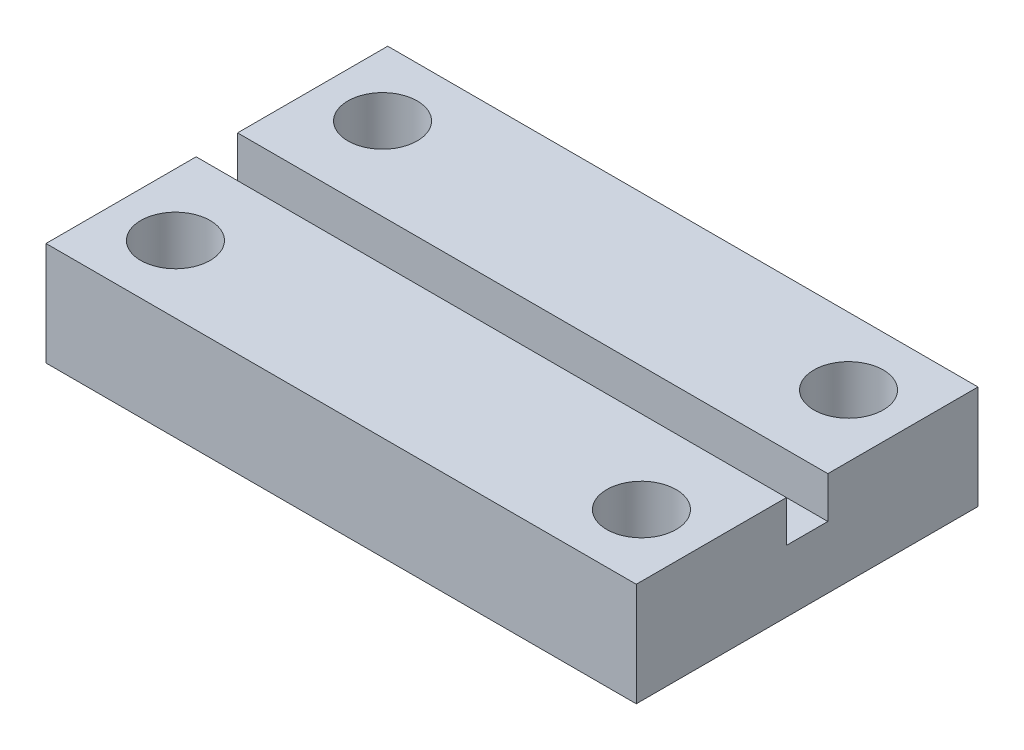
ISO-10303-21;
HEADER;
FILE_DESCRIPTION(('STEP AP214'),'2;1');
FILE_NAME('part.step','',(''),(''),'','','');
FILE_SCHEMA(('AUTOMOTIVE_DESIGN { 1 0 10303 214 1 1 1 1 }'));
ENDSEC;
DATA;
#1=APPLICATION_CONTEXT('core data for automotive mechanical design processes');
#2=APPLICATION_PROTOCOL_DEFINITION('international standard','automotive_design',2000,#1);
#3=PRODUCT_CONTEXT('',#1,'mechanical');
#4=PRODUCT('Part','Part','',(#3));
#5=PRODUCT_RELATED_PRODUCT_CATEGORY('part','',(#4));
#6=PRODUCT_DEFINITION_FORMATION('','',#4);
#7=PRODUCT_DEFINITION_CONTEXT('part definition',#1,'design');
#8=PRODUCT_DEFINITION('design','',#6,#7);
#9=PRODUCT_DEFINITION_SHAPE('','',#8);
#10=(LENGTH_UNIT() NAMED_UNIT(*) SI_UNIT(.MILLI.,.METRE.));
#11=(NAMED_UNIT(*) PLANE_ANGLE_UNIT() SI_UNIT($,.RADIAN.));
#12=(NAMED_UNIT(*) SI_UNIT($,.STERADIAN.) SOLID_ANGLE_UNIT());
#13=UNCERTAINTY_MEASURE_WITH_UNIT(LENGTH_MEASURE(1.E-05),#10,'distance_accuracy_value','');
#14=(GEOMETRIC_REPRESENTATION_CONTEXT(3) GLOBAL_UNCERTAINTY_ASSIGNED_CONTEXT((#13)) GLOBAL_UNIT_ASSIGNED_CONTEXT((#10,
#11,#12)) REPRESENTATION_CONTEXT('',''));
#15=CARTESIAN_POINT('',(0.,0.,0.));
#16=DIRECTION('',(0.,0.,1.));
#17=DIRECTION('',(1.,0.,0.));
#18=AXIS2_PLACEMENT_3D('',#15,#16,#17);
#19=CARTESIAN_POINT('',(0.,10.,0.));
#20=DIRECTION('',(0.,-1.,0.));
#21=DIRECTION('',(0.,0.,-1.));
#22=AXIS2_PLACEMENT_3D('',#19,#20,#21);
#23=PLANE('',#22);
#24=CARTESIAN_POINT('',(51.,10.,-26.5));
#25=DIRECTION('',(0.,-1.,0.));
#26=DIRECTION('',(0.,0.,-1.));
#27=AXIS2_PLACEMENT_3D('',#24,#25,#26);
#28=CIRCLE('',#27,3.35);
#29=CARTESIAN_POINT('',(51.,10.,-29.85));
#30=VERTEX_POINT('',#29);
#31=EDGE_CURVE('E145',#30,#30,#28,.T.);
#32=ORIENTED_EDGE('',*,*,#31,.T.);
#33=EDGE_LOOP('',(#32));
#34=FACE_BOUND('',#33,.T.);
#35=CARTESIAN_POINT('',(6.,10.,-26.5));
#36=DIRECTION('',(0.,-1.,0.));
#37=DIRECTION('',(0.,0.,-1.));
#38=AXIS2_PLACEMENT_3D('',#35,#36,#37);
#39=CIRCLE('',#38,3.35);
#40=CARTESIAN_POINT('',(6.,10.,-29.85));
#41=VERTEX_POINT('',#40);
#42=EDGE_CURVE('E139',#41,#41,#39,.T.);
#43=ORIENTED_EDGE('',*,*,#42,.T.);
#44=EDGE_LOOP('',(#43));
#45=FACE_BOUND('',#44,.T.);
#46=DIRECTION('',(0.,0.,1.));
#47=VECTOR('',#46,1.);
#48=CARTESIAN_POINT('',(0.,10.,0.));
#49=LINE('',#48,#47);
#50=CARTESIAN_POINT('',(0.,10.,-33.));
#51=VERTEX_POINT('',#50);
#52=CARTESIAN_POINT('',(0.,10.,-18.5));
#53=VERTEX_POINT('',#52);
#54=EDGE_CURVE('E157',#51,#53,#49,.T.);
#55=ORIENTED_EDGE('',*,*,#54,.T.);
#56=DIRECTION('',(-1.,0.,0.));
#57=VECTOR('',#56,1.);
#58=CARTESIAN_POINT('',(0.,10.,-18.5));
#59=LINE('',#58,#57);
#60=CARTESIAN_POINT('',(57.,10.,-18.5));
#61=VERTEX_POINT('',#60);
#62=EDGE_CURVE('E122',#61,#53,#59,.T.);
#63=ORIENTED_EDGE('',*,*,#62,.F.);
#64=DIRECTION('',(0.,0.,-1.));
#65=VECTOR('',#64,1.);
#66=CARTESIAN_POINT('',(57.,10.,0.));
#67=LINE('',#66,#65);
#68=CARTESIAN_POINT('',(57.,10.,-33.));
#69=VERTEX_POINT('',#68);
#70=EDGE_CURVE('E161',#61,#69,#67,.T.);
#71=ORIENTED_EDGE('',*,*,#70,.T.);
#72=DIRECTION('',(-1.,0.,0.));
#73=VECTOR('',#72,1.);
#74=CARTESIAN_POINT('',(0.,10.,-33.));
#75=LINE('',#74,#73);
#76=EDGE_CURVE('E56',#69,#51,#75,.T.);
#77=ORIENTED_EDGE('',*,*,#76,.T.);
#78=EDGE_LOOP('',(#55,#63,#71,#77));
#79=FACE_BOUND('',#78,.T.);
#80=ADVANCED_FACE('F32',(#34,#45,#79),#23,.F.);
#81=CARTESIAN_POINT('',(0.,10.,0.));
#82=DIRECTION('',(1.,0.,0.));
#83=DIRECTION('',(0.,0.,-1.));
#84=AXIS2_PLACEMENT_3D('',#81,#82,#83);
#85=PLANE('',#84);
#86=DIRECTION('',(0.,0.,1.));
#87=VECTOR('',#86,1.);
#88=CARTESIAN_POINT('',(0.,6.,-18.5));
#89=LINE('',#88,#87);
#90=CARTESIAN_POINT('',(0.,6.,-18.5));
#91=VERTEX_POINT('',#90);
#92=CARTESIAN_POINT('',(0.,6.,-14.5));
#93=VERTEX_POINT('',#92);
#94=EDGE_CURVE('E113',#91,#93,#89,.T.);
#95=ORIENTED_EDGE('',*,*,#94,.F.);
#96=DIRECTION('',(0.,1.,0.));
#97=VECTOR('',#96,1.);
#98=CARTESIAN_POINT('',(0.,6.,-18.5));
#99=LINE('',#98,#97);
#100=EDGE_CURVE('E138',#91,#53,#99,.T.);
#101=ORIENTED_EDGE('',*,*,#100,.T.);
#102=ORIENTED_EDGE('',*,*,#54,.F.);
#103=DIRECTION('',(0.,-1.,0.));
#104=VECTOR('',#103,1.);
#105=CARTESIAN_POINT('',(0.,10.,-33.));
#106=LINE('',#105,#104);
#107=CARTESIAN_POINT('',(0.,0.,-33.));
#108=VERTEX_POINT('',#107);
#109=EDGE_CURVE('E166',#51,#108,#106,.T.);
#110=ORIENTED_EDGE('',*,*,#109,.T.);
#111=DIRECTION('',(0.,0.,1.));
#112=VECTOR('',#111,1.);
#113=CARTESIAN_POINT('',(0.,0.,0.));
#114=LINE('',#113,#112);
#115=CARTESIAN_POINT('',(0.,0.,0.));
#116=VERTEX_POINT('',#115);
#117=EDGE_CURVE('E154',#108,#116,#114,.T.);
#118=ORIENTED_EDGE('',*,*,#117,.T.);
#119=DIRECTION('',(0.,-1.,0.));
#120=VECTOR('',#119,1.);
#121=CARTESIAN_POINT('',(0.,10.,0.));
#122=LINE('',#121,#120);
#123=CARTESIAN_POINT('',(0.,10.,0.));
#124=VERTEX_POINT('',#123);
#125=EDGE_CURVE('E11',#124,#116,#122,.T.);
#126=ORIENTED_EDGE('',*,*,#125,.F.);
#127=CARTESIAN_POINT('',(0.,10.,-14.5));
#128=VERTEX_POINT('',#127);
#129=EDGE_CURVE('E84',#128,#124,#49,.T.);
#130=ORIENTED_EDGE('',*,*,#129,.F.);
#131=DIRECTION('',(0.,1.,0.));
#132=VECTOR('',#131,1.);
#133=CARTESIAN_POINT('',(0.,6.,-14.5));
#134=LINE('',#133,#132);
#135=EDGE_CURVE('E47',#93,#128,#134,.T.);
#136=ORIENTED_EDGE('',*,*,#135,.F.);
#137=EDGE_LOOP('',(#95,#101,#102,#110,#118,#126,#130,#136));
#138=FACE_BOUND('',#137,.T.);
#139=ADVANCED_FACE('F34',(#138),#85,.F.);
#140=CARTESIAN_POINT('',(0.,10.,0.));
#141=DIRECTION('',(0.,0.,-1.));
#142=DIRECTION('',(-1.,0.,0.));
#143=AXIS2_PLACEMENT_3D('',#140,#141,#142);
#144=PLANE('',#143);
#145=DIRECTION('',(1.,0.,0.));
#146=VECTOR('',#145,1.);
#147=CARTESIAN_POINT('',(0.,0.,0.));
#148=LINE('',#147,#146);
#149=CARTESIAN_POINT('',(57.,0.,0.));
#150=VERTEX_POINT('',#149);
#151=EDGE_CURVE('E169',#116,#150,#148,.T.);
#152=ORIENTED_EDGE('',*,*,#151,.T.);
#153=DIRECTION('',(0.,-1.,0.));
#154=VECTOR('',#153,1.);
#155=CARTESIAN_POINT('',(57.,10.,0.));
#156=LINE('',#155,#154);
#157=CARTESIAN_POINT('',(57.,10.,0.));
#158=VERTEX_POINT('',#157);
#159=EDGE_CURVE('E40',#158,#150,#156,.T.);
#160=ORIENTED_EDGE('',*,*,#159,.F.);
#161=DIRECTION('',(1.,0.,0.));
#162=VECTOR('',#161,1.);
#163=CARTESIAN_POINT('',(0.,10.,0.));
#164=LINE('',#163,#162);
#165=EDGE_CURVE('E159',#124,#158,#164,.T.);
#166=ORIENTED_EDGE('',*,*,#165,.F.);
#167=ORIENTED_EDGE('',*,*,#125,.T.);
#168=EDGE_LOOP('',(#152,#160,#166,#167));
#169=FACE_BOUND('',#168,.T.);
#170=ADVANCED_FACE('F217',(#169),#144,.F.);
#171=CARTESIAN_POINT('',(57.,10.,0.));
#172=DIRECTION('',(-1.,0.,0.));
#173=DIRECTION('',(0.,0.,1.));
#174=AXIS2_PLACEMENT_3D('',#171,#172,#173);
#175=PLANE('',#174);
#176=ORIENTED_EDGE('',*,*,#70,.F.);
#177=DIRECTION('',(0.,1.,0.));
#178=VECTOR('',#177,1.);
#179=CARTESIAN_POINT('',(57.,6.,-18.5));
#180=LINE('',#179,#178);
#181=CARTESIAN_POINT('',(57.,6.,-18.5));
#182=VERTEX_POINT('',#181);
#183=EDGE_CURVE('E126',#182,#61,#180,.T.);
#184=ORIENTED_EDGE('',*,*,#183,.F.);
#185=DIRECTION('',(0.,0.,-1.));
#186=VECTOR('',#185,1.);
#187=CARTESIAN_POINT('',(57.,6.,-18.5));
#188=LINE('',#187,#186);
#189=CARTESIAN_POINT('',(57.,6.,-14.5));
#190=VERTEX_POINT('',#189);
#191=EDGE_CURVE('E112',#190,#182,#188,.T.);
#192=ORIENTED_EDGE('',*,*,#191,.F.);
#193=DIRECTION('',(0.,1.,0.));
#194=VECTOR('',#193,1.);
#195=CARTESIAN_POINT('',(57.,6.,-14.5));
#196=LINE('',#195,#194);
#197=CARTESIAN_POINT('',(57.,10.,-14.5));
#198=VERTEX_POINT('',#197);
#199=EDGE_CURVE('E109',#190,#198,#196,.T.);
#200=ORIENTED_EDGE('',*,*,#199,.T.);
#201=EDGE_CURVE('E162',#158,#198,#67,.T.);
#202=ORIENTED_EDGE('',*,*,#201,.F.);
#203=ORIENTED_EDGE('',*,*,#159,.T.);
#204=DIRECTION('',(0.,0.,-1.));
#205=VECTOR('',#204,1.);
#206=CARTESIAN_POINT('',(57.,0.,0.));
#207=LINE('',#206,#205);
#208=CARTESIAN_POINT('',(57.,0.,-33.));
#209=VERTEX_POINT('',#208);
#210=EDGE_CURVE('E171',#150,#209,#207,.T.);
#211=ORIENTED_EDGE('',*,*,#210,.T.);
#212=DIRECTION('',(0.,-1.,0.));
#213=VECTOR('',#212,1.);
#214=CARTESIAN_POINT('',(57.,10.,-33.));
#215=LINE('',#214,#213);
#216=EDGE_CURVE('E175',#69,#209,#215,.T.);
#217=ORIENTED_EDGE('',*,*,#216,.F.);
#218=EDGE_LOOP('',(#176,#184,#192,#200,#202,#203,#211,#217));
#219=FACE_BOUND('',#218,.T.);
#220=ADVANCED_FACE('F182',(#219),#175,.F.);
#221=CARTESIAN_POINT('',(0.,10.,-33.));
#222=DIRECTION('',(0.,0.,1.));
#223=DIRECTION('',(1.,0.,0.));
#224=AXIS2_PLACEMENT_3D('',#221,#222,#223);
#225=PLANE('',#224);
#226=DIRECTION('',(-1.,0.,0.));
#227=VECTOR('',#226,1.);
#228=CARTESIAN_POINT('',(0.,0.,-33.));
#229=LINE('',#228,#227);
#230=EDGE_CURVE('E77',#209,#108,#229,.T.);
#231=ORIENTED_EDGE('',*,*,#230,.T.);
#232=ORIENTED_EDGE('',*,*,#109,.F.);
#233=ORIENTED_EDGE('',*,*,#76,.F.);
#234=ORIENTED_EDGE('',*,*,#216,.T.);
#235=EDGE_LOOP('',(#231,#232,#233,#234));
#236=FACE_BOUND('',#235,.T.);
#237=ADVANCED_FACE('F189',(#236),#225,.F.);
#238=CARTESIAN_POINT('',(51.,10.,-6.5));
#239=DIRECTION('',(0.,-1.,0.));
#240=DIRECTION('',(0.,0.,-1.));
#241=AXIS2_PLACEMENT_3D('',#238,#239,#240);
#242=CIRCLE('',#241,3.35);
#243=CARTESIAN_POINT('',(51.,10.,-9.85));
#244=VERTEX_POINT('',#243);
#245=EDGE_CURVE('E131',#244,#244,#242,.T.);
#246=ORIENTED_EDGE('',*,*,#245,.T.);
#247=EDGE_LOOP('',(#246));
#248=FACE_BOUND('',#247,.T.);
#249=CARTESIAN_POINT('',(6.,10.,-6.5));
#250=DIRECTION('',(0.,-1.,0.));
#251=DIRECTION('',(0.,0.,-1.));
#252=AXIS2_PLACEMENT_3D('',#249,#250,#251);
#253=CIRCLE('',#252,3.35);
#254=CARTESIAN_POINT('',(6.,10.,-9.85));
#255=VERTEX_POINT('',#254);
#256=EDGE_CURVE('E151',#255,#255,#253,.T.);
#257=ORIENTED_EDGE('',*,*,#256,.T.);
#258=EDGE_LOOP('',(#257));
#259=FACE_BOUND('',#258,.T.);
#260=ORIENTED_EDGE('',*,*,#201,.T.);
#261=DIRECTION('',(1.,0.,0.));
#262=VECTOR('',#261,1.);
#263=CARTESIAN_POINT('',(0.,10.,-14.5));
#264=LINE('',#263,#262);
#265=EDGE_CURVE('E193',#128,#198,#264,.T.);
#266=ORIENTED_EDGE('',*,*,#265,.F.);
#267=ORIENTED_EDGE('',*,*,#129,.T.);
#268=ORIENTED_EDGE('',*,*,#165,.T.);
#269=EDGE_LOOP('',(#260,#266,#267,#268));
#270=FACE_BOUND('',#269,.T.);
#271=ADVANCED_FACE('F213',(#248,#259,#270),#23,.F.);
#272=CARTESIAN_POINT('',(0.,0.,0.));
#273=DIRECTION('',(0.,-1.,0.));
#274=DIRECTION('',(0.,0.,-1.));
#275=AXIS2_PLACEMENT_3D('',#272,#273,#274);
#276=PLANE('',#275);
#277=CARTESIAN_POINT('',(51.,0.,-6.5));
#278=DIRECTION('',(0.,-1.,0.));
#279=DIRECTION('',(0.,0.,-1.));
#280=AXIS2_PLACEMENT_3D('',#277,#278,#279);
#281=CIRCLE('',#280,3.35);
#282=CARTESIAN_POINT('',(51.,0.,-9.85));
#283=VERTEX_POINT('',#282);
#284=EDGE_CURVE('E135',#283,#283,#281,.T.);
#285=ORIENTED_EDGE('',*,*,#284,.F.);
#286=EDGE_LOOP('',(#285));
#287=FACE_BOUND('',#286,.T.);
#288=CARTESIAN_POINT('',(6.,0.,-26.5));
#289=DIRECTION('',(0.,-1.,0.));
#290=DIRECTION('',(0.,0.,-1.));
#291=AXIS2_PLACEMENT_3D('',#288,#289,#290);
#292=CIRCLE('',#291,3.35);
#293=CARTESIAN_POINT('',(6.,0.,-29.85));
#294=VERTEX_POINT('',#293);
#295=EDGE_CURVE('E134',#294,#294,#292,.T.);
#296=ORIENTED_EDGE('',*,*,#295,.F.);
#297=EDGE_LOOP('',(#296));
#298=FACE_BOUND('',#297,.T.);
#299=CARTESIAN_POINT('',(51.,0.,-26.5));
#300=DIRECTION('',(0.,-1.,0.));
#301=DIRECTION('',(0.,0.,-1.));
#302=AXIS2_PLACEMENT_3D('',#299,#300,#301);
#303=CIRCLE('',#302,3.35);
#304=CARTESIAN_POINT('',(51.,0.,-29.85));
#305=VERTEX_POINT('',#304);
#306=EDGE_CURVE('E142',#305,#305,#303,.T.);
#307=ORIENTED_EDGE('',*,*,#306,.F.);
#308=EDGE_LOOP('',(#307));
#309=FACE_BOUND('',#308,.T.);
#310=CARTESIAN_POINT('',(6.,0.,-6.5));
#311=DIRECTION('',(0.,-1.,0.));
#312=DIRECTION('',(0.,0.,-1.));
#313=AXIS2_PLACEMENT_3D('',#310,#311,#312);
#314=CIRCLE('',#313,3.35);
#315=CARTESIAN_POINT('',(6.,0.,-9.85));
#316=VERTEX_POINT('',#315);
#317=EDGE_CURVE('E148',#316,#316,#314,.T.);
#318=ORIENTED_EDGE('',*,*,#317,.F.);
#319=EDGE_LOOP('',(#318));
#320=FACE_BOUND('',#319,.T.);
#321=ORIENTED_EDGE('',*,*,#117,.F.);
#322=ORIENTED_EDGE('',*,*,#230,.F.);
#323=ORIENTED_EDGE('',*,*,#210,.F.);
#324=ORIENTED_EDGE('',*,*,#151,.F.);
#325=EDGE_LOOP('',(#321,#322,#323,#324));
#326=FACE_BOUND('',#325,.T.);
#327=ADVANCED_FACE('F187',(#287,#298,#309,#320,#326),#276,.T.);
#328=CARTESIAN_POINT('',(6.,10.,-6.5));
#329=DIRECTION('',(0.,-1.,0.));
#330=DIRECTION('',(0.,0.,-1.));
#331=AXIS2_PLACEMENT_3D('',#328,#329,#330);
#332=CYLINDRICAL_SURFACE('',#331,3.35);
#333=ORIENTED_EDGE('',*,*,#256,.F.);
#334=EDGE_LOOP('',(#333));
#335=FACE_BOUND('',#334,.T.);
#336=ORIENTED_EDGE('',*,*,#317,.T.);
#337=EDGE_LOOP('',(#336));
#338=FACE_BOUND('',#337,.T.);
#339=ADVANCED_FACE('F227',(#335,#338),#332,.F.);
#340=CARTESIAN_POINT('',(51.,10.,-26.5));
#341=DIRECTION('',(0.,-1.,0.));
#342=DIRECTION('',(0.,0.,-1.));
#343=AXIS2_PLACEMENT_3D('',#340,#341,#342);
#344=CYLINDRICAL_SURFACE('',#343,3.35);
#345=ORIENTED_EDGE('',*,*,#31,.F.);
#346=EDGE_LOOP('',(#345));
#347=FACE_BOUND('',#346,.T.);
#348=ORIENTED_EDGE('',*,*,#306,.T.);
#349=EDGE_LOOP('',(#348));
#350=FACE_BOUND('',#349,.T.);
#351=ADVANCED_FACE('F257',(#347,#350),#344,.F.);
#352=CARTESIAN_POINT('',(6.,10.,-26.5));
#353=DIRECTION('',(0.,-1.,0.));
#354=DIRECTION('',(0.,0.,-1.));
#355=AXIS2_PLACEMENT_3D('',#352,#353,#354);
#356=CYLINDRICAL_SURFACE('',#355,3.35);
#357=ORIENTED_EDGE('',*,*,#42,.F.);
#358=EDGE_LOOP('',(#357));
#359=FACE_BOUND('',#358,.T.);
#360=ORIENTED_EDGE('',*,*,#295,.T.);
#361=EDGE_LOOP('',(#360));
#362=FACE_BOUND('',#361,.T.);
#363=ADVANCED_FACE('F206',(#359,#362),#356,.F.);
#364=CARTESIAN_POINT('',(51.,10.,-6.5));
#365=DIRECTION('',(0.,-1.,0.));
#366=DIRECTION('',(0.,0.,-1.));
#367=AXIS2_PLACEMENT_3D('',#364,#365,#366);
#368=CYLINDRICAL_SURFACE('',#367,3.35);
#369=ORIENTED_EDGE('',*,*,#245,.F.);
#370=EDGE_LOOP('',(#369));
#371=FACE_BOUND('',#370,.T.);
#372=ORIENTED_EDGE('',*,*,#284,.T.);
#373=EDGE_LOOP('',(#372));
#374=FACE_BOUND('',#373,.T.);
#375=ADVANCED_FACE('F199',(#371,#374),#368,.F.);
#376=CARTESIAN_POINT('',(0.,6.,-18.5));
#377=DIRECTION('',(0.,0.,-1.));
#378=DIRECTION('',(-1.,0.,0.));
#379=AXIS2_PLACEMENT_3D('',#376,#377,#378);
#380=PLANE('',#379);
#381=ORIENTED_EDGE('',*,*,#62,.T.);
#382=ORIENTED_EDGE('',*,*,#100,.F.);
#383=DIRECTION('',(-1.,0.,0.));
#384=VECTOR('',#383,1.);
#385=CARTESIAN_POINT('',(0.,6.,-18.5));
#386=LINE('',#385,#384);
#387=EDGE_CURVE('E119',#182,#91,#386,.T.);
#388=ORIENTED_EDGE('',*,*,#387,.F.);
#389=ORIENTED_EDGE('',*,*,#183,.T.);
#390=EDGE_LOOP('',(#381,#382,#388,#389));
#391=FACE_BOUND('',#390,.T.);
#392=ADVANCED_FACE('F197',(#391),#380,.F.);
#393=CARTESIAN_POINT('',(0.,6.,-14.5));
#394=DIRECTION('',(0.,0.,1.));
#395=DIRECTION('',(1.,0.,0.));
#396=AXIS2_PLACEMENT_3D('',#393,#394,#395);
#397=PLANE('',#396);
#398=ORIENTED_EDGE('',*,*,#265,.T.);
#399=ORIENTED_EDGE('',*,*,#199,.F.);
#400=DIRECTION('',(1.,0.,0.));
#401=VECTOR('',#400,1.);
#402=CARTESIAN_POINT('',(0.,6.,-14.5));
#403=LINE('',#402,#401);
#404=EDGE_CURVE('E105',#93,#190,#403,.T.);
#405=ORIENTED_EDGE('',*,*,#404,.F.);
#406=ORIENTED_EDGE('',*,*,#135,.T.);
#407=EDGE_LOOP('',(#398,#399,#405,#406));
#408=FACE_BOUND('',#407,.T.);
#409=ADVANCED_FACE('F107',(#408),#397,.F.);
#410=CARTESIAN_POINT('',(0.,6.,0.));
#411=DIRECTION('',(0.,1.,0.));
#412=DIRECTION('',(0.,0.,1.));
#413=AXIS2_PLACEMENT_3D('',#410,#411,#412);
#414=PLANE('',#413);
#415=ORIENTED_EDGE('',*,*,#94,.T.);
#416=ORIENTED_EDGE('',*,*,#404,.T.);
#417=ORIENTED_EDGE('',*,*,#191,.T.);
#418=ORIENTED_EDGE('',*,*,#387,.T.);
#419=EDGE_LOOP('',(#415,#416,#417,#418));
#420=FACE_BOUND('',#419,.T.);
#421=ADVANCED_FACE('F117',(#420),#414,.T.);
#422=CLOSED_SHELL('',(#80,#139,#170,#220,#237,#271,#327,#339,#351,#363,#375,#392,#409,#421));
#423=MANIFOLD_SOLID_BREP('B2',#422);
#424=ADVANCED_BREP_SHAPE_REPRESENTATION('',(#18,#423),#14);
#425=SHAPE_DEFINITION_REPRESENTATION(#9,#424);
ENDSEC;
END-ISO-10303-21;
